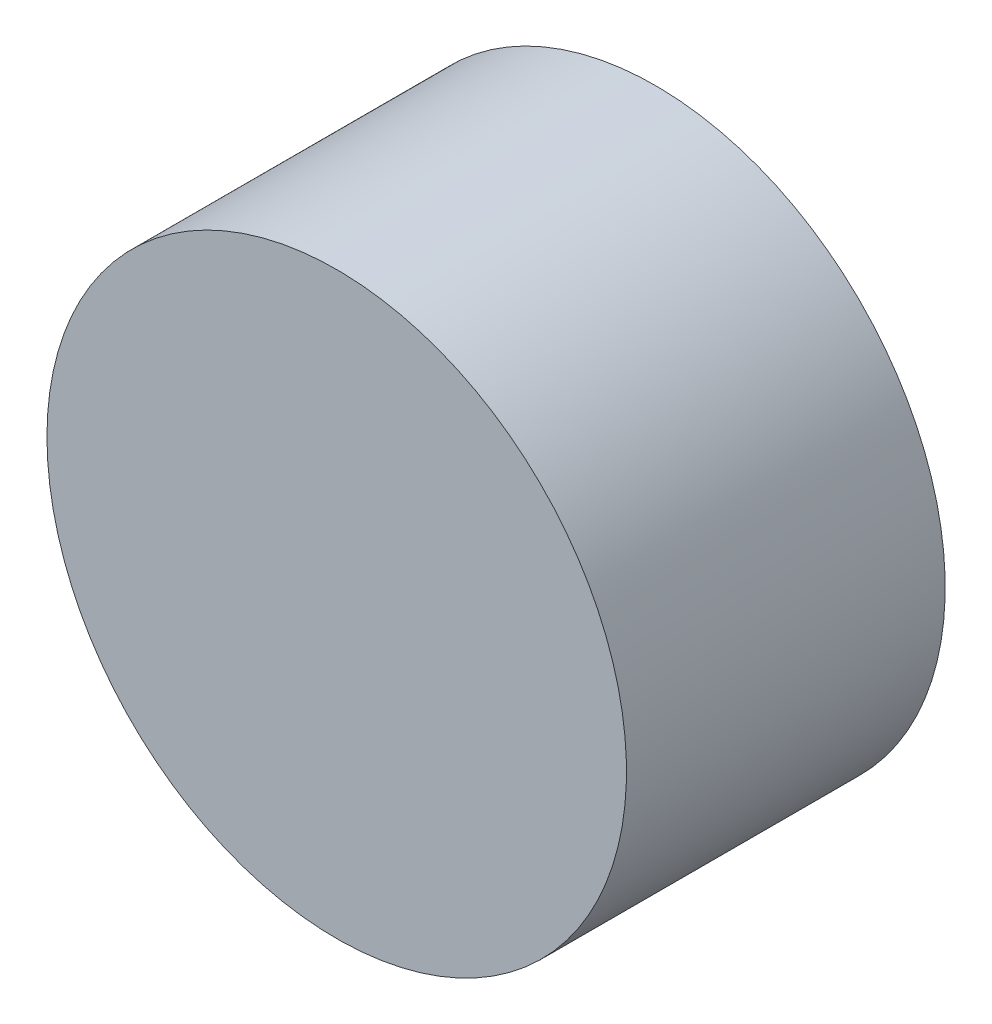
ISO-10303-21;
HEADER;
FILE_DESCRIPTION(('STEP AP214'),'2;1');
FILE_NAME('part.step','',(''),(''),'','','');
FILE_SCHEMA(('AUTOMOTIVE_DESIGN { 1 0 10303 214 1 1 1 1 }'));
ENDSEC;
DATA;
#1=APPLICATION_CONTEXT('core data for automotive mechanical design processes');
#2=APPLICATION_PROTOCOL_DEFINITION('international standard','automotive_design',2000,#1);
#3=PRODUCT_CONTEXT('',#1,'mechanical');
#4=PRODUCT('Part','Part','',(#3));
#5=PRODUCT_RELATED_PRODUCT_CATEGORY('part','',(#4));
#6=PRODUCT_DEFINITION_FORMATION('','',#4);
#7=PRODUCT_DEFINITION_CONTEXT('part definition',#1,'design');
#8=PRODUCT_DEFINITION('design','',#6,#7);
#9=PRODUCT_DEFINITION_SHAPE('','',#8);
#10=(LENGTH_UNIT() NAMED_UNIT(*) SI_UNIT(.MILLI.,.METRE.));
#11=(NAMED_UNIT(*) PLANE_ANGLE_UNIT() SI_UNIT($,.RADIAN.));
#12=(NAMED_UNIT(*) SI_UNIT($,.STERADIAN.) SOLID_ANGLE_UNIT());
#13=UNCERTAINTY_MEASURE_WITH_UNIT(LENGTH_MEASURE(1.E-05),#10,'distance_accuracy_value','');
#14=(GEOMETRIC_REPRESENTATION_CONTEXT(3) GLOBAL_UNCERTAINTY_ASSIGNED_CONTEXT((#13)) GLOBAL_UNIT_ASSIGNED_CONTEXT((#10,
#11,#12)) REPRESENTATION_CONTEXT('',''));
#15=CARTESIAN_POINT('',(0.,0.,0.));
#16=DIRECTION('',(0.,0.,1.));
#17=DIRECTION('',(1.,0.,0.));
#18=AXIS2_PLACEMENT_3D('',#15,#16,#17);
#19=CARTESIAN_POINT('',(0.499999,0.,0.));
#20=DIRECTION('',(0.,0.,-1.));
#21=DIRECTION('',(-1.,0.,0.));
#22=AXIS2_PLACEMENT_3D('',#19,#20,#21);
#23=PLANE('',#22);
#24=CARTESIAN_POINT('',(0.,0.,0.));
#25=DIRECTION('',(0.,0.,-1.));
#26=DIRECTION('',(-1.,0.,0.));
#27=AXIS2_PLACEMENT_3D('',#24,#25,#26);
#28=CIRCLE('',#27,0.499999);
#29=CARTESIAN_POINT('',(-0.499999,0.,0.));
#30=VERTEX_POINT('',#29);
#31=EDGE_CURVE('E18',#30,#30,#28,.F.);
#32=ORIENTED_EDGE('',*,*,#31,.F.);
#33=EDGE_LOOP('',(#32));
#34=FACE_BOUND('',#33,.T.);
#35=ADVANCED_FACE('F15',(#34),#23,.T.);
#36=CARTESIAN_POINT('',(0.499999,0.,0.5499989));
#37=DIRECTION('',(0.,0.,-1.));
#38=DIRECTION('',(-1.,0.,0.));
#39=AXIS2_PLACEMENT_3D('',#36,#37,#38);
#40=PLANE('',#39);
#41=CARTESIAN_POINT('',(0.,0.,0.5499989));
#42=DIRECTION('',(0.,0.,-1.));
#43=DIRECTION('',(-1.,0.,0.));
#44=AXIS2_PLACEMENT_3D('',#41,#42,#43);
#45=CIRCLE('',#44,0.499999);
#46=CARTESIAN_POINT('',(-0.499999,0.,0.5499989));
#47=VERTEX_POINT('',#46);
#48=EDGE_CURVE('E10',#47,#47,#45,.T.);
#49=ORIENTED_EDGE('',*,*,#48,.F.);
#50=EDGE_LOOP('',(#49));
#51=FACE_BOUND('',#50,.T.);
#52=ADVANCED_FACE('F30',(#51),#40,.F.);
#53=CARTESIAN_POINT('',(0.,0.,0.));
#54=DIRECTION('',(0.,0.,-1.));
#55=DIRECTION('',(-1.,0.,0.));
#56=AXIS2_PLACEMENT_3D('',#53,#54,#55);
#57=CYLINDRICAL_SURFACE('',#56,0.499999);
#58=ORIENTED_EDGE('',*,*,#31,.T.);
#59=EDGE_LOOP('',(#58));
#60=FACE_BOUND('',#59,.T.);
#61=ORIENTED_EDGE('',*,*,#48,.T.);
#62=EDGE_LOOP('',(#61));
#63=FACE_BOUND('',#62,.T.);
#64=ADVANCED_FACE('F27',(#60,#63),#57,.T.);
#65=CLOSED_SHELL('',(#35,#52,#64));
#66=MANIFOLD_SOLID_BREP('B1',#65);
#67=ADVANCED_BREP_SHAPE_REPRESENTATION('',(#18,#66),#14);
#68=SHAPE_DEFINITION_REPRESENTATION(#9,#67);
ENDSEC;
END-ISO-10303-21;
